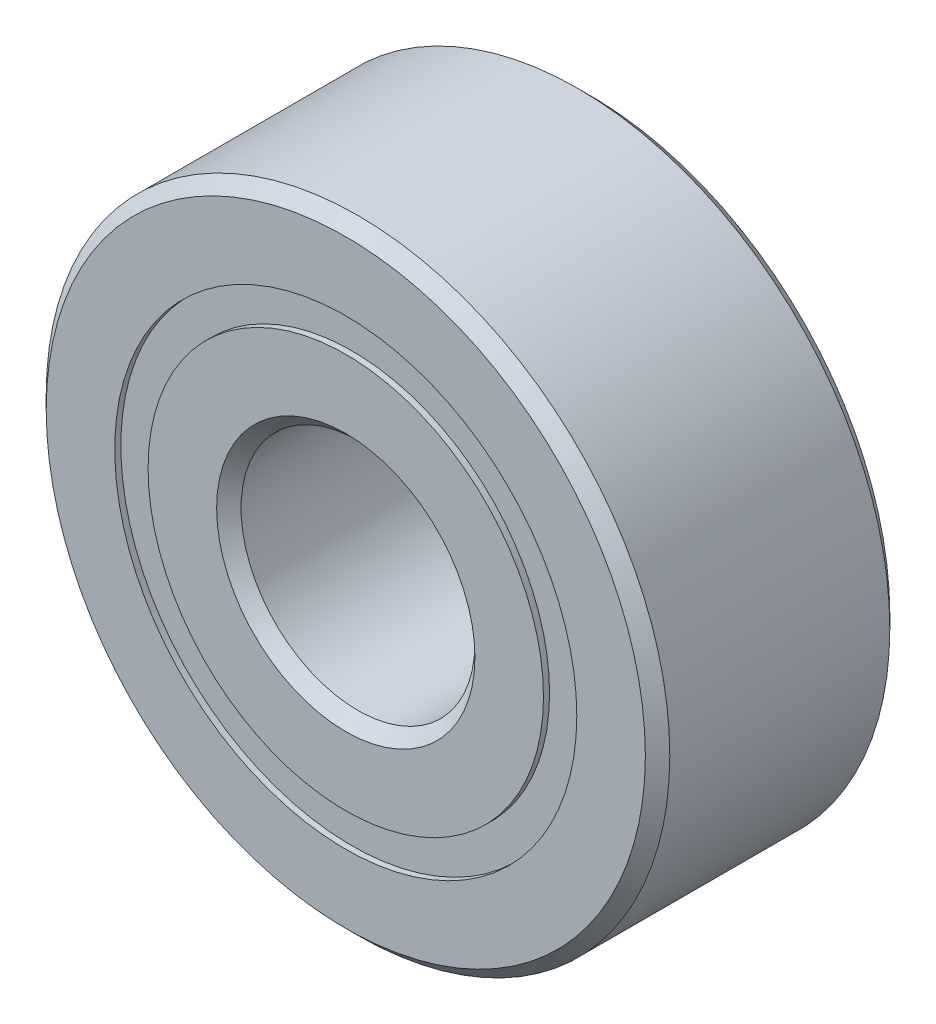
ISO-10303-21;
HEADER;
FILE_DESCRIPTION(('STEP AP214'),'2;1');
FILE_NAME('part.step','',(''),(''),'','','');
FILE_SCHEMA(('AUTOMOTIVE_DESIGN { 1 0 10303 214 1 1 1 1 }'));
ENDSEC;
DATA;
#1=APPLICATION_CONTEXT('core data for automotive mechanical design processes');
#2=APPLICATION_PROTOCOL_DEFINITION('international standard','automotive_design',2000,#1);
#3=PRODUCT_CONTEXT('',#1,'mechanical');
#4=PRODUCT('Part','Part','',(#3));
#5=PRODUCT_RELATED_PRODUCT_CATEGORY('part','',(#4));
#6=PRODUCT_DEFINITION_FORMATION('','',#4);
#7=PRODUCT_DEFINITION_CONTEXT('part definition',#1,'design');
#8=PRODUCT_DEFINITION('design','',#6,#7);
#9=PRODUCT_DEFINITION_SHAPE('','',#8);
#10=(LENGTH_UNIT() NAMED_UNIT(*) SI_UNIT(.MILLI.,.METRE.));
#11=(NAMED_UNIT(*) PLANE_ANGLE_UNIT() SI_UNIT($,.RADIAN.));
#12=(NAMED_UNIT(*) SI_UNIT($,.STERADIAN.) SOLID_ANGLE_UNIT());
#13=UNCERTAINTY_MEASURE_WITH_UNIT(LENGTH_MEASURE(1.E-05),#10,'distance_accuracy_value','');
#14=(GEOMETRIC_REPRESENTATION_CONTEXT(3) GLOBAL_UNCERTAINTY_ASSIGNED_CONTEXT((#13)) GLOBAL_UNIT_ASSIGNED_CONTEXT((#10,
#11,#12)) REPRESENTATION_CONTEXT('',''));
#15=CARTESIAN_POINT('',(0.,0.,0.));
#16=DIRECTION('',(0.,0.,1.));
#17=DIRECTION('',(1.,0.,0.));
#18=AXIS2_PLACEMENT_3D('',#15,#16,#17);
#19=CARTESIAN_POINT('',(0.,4.70503598901099,-2.36474000000001));
#20=DIRECTION('',(0.,0.,1.));
#21=DIRECTION('',(1.,0.,0.));
#22=AXIS2_PLACEMENT_3D('',#19,#20,#21);
#23=PLANE('',#22);
#24=CARTESIAN_POINT('',(0.,0.,-2.36474000000001));
#25=DIRECTION('',(0.,0.,1.));
#26=DIRECTION('',(1.,0.,0.));
#27=AXIS2_PLACEMENT_3D('',#24,#25,#26);
#28=CIRCLE('',#27,4.70503598901099);
#29=CARTESIAN_POINT('',(4.70503598901099,0.,-2.36474000000001));
#30=VERTEX_POINT('',#29);
#31=EDGE_CURVE('E70',#30,#30,#28,.T.);
#32=ORIENTED_EDGE('',*,*,#31,.F.);
#33=EDGE_LOOP('',(#32));
#34=FACE_BOUND('',#33,.T.);
#35=CARTESIAN_POINT('',(0.,0.,-2.36474000000001));
#36=DIRECTION('',(0.,0.,1.));
#37=DIRECTION('',(1.,0.,0.));
#38=AXIS2_PLACEMENT_3D('',#35,#36,#37);
#39=CIRCLE('',#38,4.02621401098901);
#40=CARTESIAN_POINT('',(4.02621401098901,0.,-2.36474000000001));
#41=VERTEX_POINT('',#40);
#42=EDGE_CURVE('E11',#41,#41,#39,.T.);
#43=ORIENTED_EDGE('',*,*,#42,.T.);
#44=EDGE_LOOP('',(#43));
#45=FACE_BOUND('',#44,.T.);
#46=ADVANCED_FACE('F56',(#34,#45),#23,.F.);
#47=CARTESIAN_POINT('',(0.,0.,2.4892));
#48=DIRECTION('',(0.,0.,1.));
#49=DIRECTION('',(1.,0.,0.));
#50=AXIS2_PLACEMENT_3D('',#47,#48,#49);
#51=CYLINDRICAL_SURFACE('',#50,4.02621401098901);
#52=ORIENTED_EDGE('',*,*,#42,.F.);
#53=EDGE_LOOP('',(#52));
#54=FACE_BOUND('',#53,.T.);
#55=CARTESIAN_POINT('',(0.,0.,-1.15720529467736));
#56=DIRECTION('',(0.,0.,1.));
#57=DIRECTION('',(1.,0.,0.));
#58=AXIS2_PLACEMENT_3D('',#55,#56,#57);
#59=CIRCLE('',#58,4.02621401098901);
#60=CARTESIAN_POINT('',(4.02621401098901,0.,-1.15720529467736));
#61=VERTEX_POINT('',#60);
#62=EDGE_CURVE('E62',#61,#61,#59,.T.);
#63=ORIENTED_EDGE('',*,*,#62,.T.);
#64=EDGE_LOOP('',(#63));
#65=FACE_BOUND('',#64,.T.);
#66=ADVANCED_FACE('F79',(#54,#65),#51,.F.);
#67=CARTESIAN_POINT('',(0.,4.70503598901099,-1.15720529467736));
#68=DIRECTION('',(0.,0.,-1.));
#69=DIRECTION('',(-1.,0.,0.));
#70=AXIS2_PLACEMENT_3D('',#67,#68,#69);
#71=PLANE('',#70);
#72=ORIENTED_EDGE('',*,*,#62,.F.);
#73=EDGE_LOOP('',(#72));
#74=FACE_BOUND('',#73,.T.);
#75=CARTESIAN_POINT('',(0.,0.,-1.15720529467736));
#76=DIRECTION('',(0.,0.,1.));
#77=DIRECTION('',(1.,0.,0.));
#78=AXIS2_PLACEMENT_3D('',#75,#76,#77);
#79=CIRCLE('',#78,4.70503598901099);
#80=CARTESIAN_POINT('',(4.70503598901099,0.,-1.15720529467736));
#81=VERTEX_POINT('',#80);
#82=EDGE_CURVE('E66',#81,#81,#79,.T.);
#83=ORIENTED_EDGE('',*,*,#82,.T.);
#84=EDGE_LOOP('',(#83));
#85=FACE_BOUND('',#84,.T.);
#86=ADVANCED_FACE('F83',(#74,#85),#71,.F.);
#87=CARTESIAN_POINT('',(0.,0.,2.4892));
#88=DIRECTION('',(0.,0.,1.));
#89=DIRECTION('',(1.,0.,0.));
#90=AXIS2_PLACEMENT_3D('',#87,#88,#89);
#91=CYLINDRICAL_SURFACE('',#90,4.70503598901099);
#92=ORIENTED_EDGE('',*,*,#82,.F.);
#93=EDGE_LOOP('',(#92));
#94=FACE_BOUND('',#93,.T.);
#95=ORIENTED_EDGE('',*,*,#31,.T.);
#96=EDGE_LOOP('',(#95));
#97=FACE_BOUND('',#96,.T.);
#98=ADVANCED_FACE('F76',(#94,#97),#91,.T.);
#99=CLOSED_SHELL('',(#46,#66,#86,#98));
#100=MANIFOLD_SOLID_BREP('B2',#99);
#101=CARTESIAN_POINT('',(0.,4.70503598901099,2.36474));
#102=DIRECTION('',(0.,0.,-1.));
#103=DIRECTION('',(-1.,0.,0.));
#104=AXIS2_PLACEMENT_3D('',#101,#102,#103);
#105=PLANE('',#104);
#106=CARTESIAN_POINT('',(0.,0.,2.36474));
#107=DIRECTION('',(0.,0.,1.));
#108=DIRECTION('',(1.,0.,0.));
#109=AXIS2_PLACEMENT_3D('',#106,#107,#108);
#110=CIRCLE('',#109,4.02621401098901);
#111=CARTESIAN_POINT('',(4.02621401098901,0.,2.36474));
#112=VERTEX_POINT('',#111);
#113=EDGE_CURVE('E55',#112,#112,#110,.T.);
#114=ORIENTED_EDGE('',*,*,#113,.F.);
#115=EDGE_LOOP('',(#114));
#116=FACE_BOUND('',#115,.T.);
#117=CARTESIAN_POINT('',(0.,0.,2.36474));
#118=DIRECTION('',(0.,0.,1.));
#119=DIRECTION('',(1.,0.,0.));
#120=AXIS2_PLACEMENT_3D('',#117,#118,#119);
#121=CIRCLE('',#120,4.70503598901099);
#122=CARTESIAN_POINT('',(4.70503598901099,0.,2.36474));
#123=VERTEX_POINT('',#122);
#124=EDGE_CURVE('E146',#123,#123,#121,.T.);
#125=ORIENTED_EDGE('',*,*,#124,.T.);
#126=EDGE_LOOP('',(#125));
#127=FACE_BOUND('',#126,.T.);
#128=ADVANCED_FACE('F132',(#116,#127),#105,.F.);
#129=CARTESIAN_POINT('',(0.,0.,2.4892));
#130=DIRECTION('',(0.,0.,1.));
#131=DIRECTION('',(1.,0.,0.));
#132=AXIS2_PLACEMENT_3D('',#129,#130,#131);
#133=CYLINDRICAL_SURFACE('',#132,4.02621401098901);
#134=CARTESIAN_POINT('',(0.,0.,1.15720529467736));
#135=DIRECTION('',(0.,0.,1.));
#136=DIRECTION('',(1.,0.,0.));
#137=AXIS2_PLACEMENT_3D('',#134,#135,#136);
#138=CIRCLE('',#137,4.02621401098901);
#139=CARTESIAN_POINT('',(4.02621401098901,0.,1.15720529467736));
#140=VERTEX_POINT('',#139);
#141=EDGE_CURVE('E138',#140,#140,#138,.T.);
#142=ORIENTED_EDGE('',*,*,#141,.F.);
#143=EDGE_LOOP('',(#142));
#144=FACE_BOUND('',#143,.T.);
#145=ORIENTED_EDGE('',*,*,#113,.T.);
#146=EDGE_LOOP('',(#145));
#147=FACE_BOUND('',#146,.T.);
#148=ADVANCED_FACE('F161',(#144,#147),#133,.F.);
#149=CARTESIAN_POINT('',(0.,4.70503598901099,1.15720529467736));
#150=DIRECTION('',(0.,0.,1.));
#151=DIRECTION('',(1.,0.,0.));
#152=AXIS2_PLACEMENT_3D('',#149,#150,#151);
#153=PLANE('',#152);
#154=CARTESIAN_POINT('',(0.,0.,1.15720529467736));
#155=DIRECTION('',(0.,0.,1.));
#156=DIRECTION('',(1.,0.,0.));
#157=AXIS2_PLACEMENT_3D('',#154,#155,#156);
#158=CIRCLE('',#157,4.70503598901099);
#159=CARTESIAN_POINT('',(4.70503598901099,0.,1.15720529467736));
#160=VERTEX_POINT('',#159);
#161=EDGE_CURVE('E142',#160,#160,#158,.T.);
#162=ORIENTED_EDGE('',*,*,#161,.F.);
#163=EDGE_LOOP('',(#162));
#164=FACE_BOUND('',#163,.T.);
#165=ORIENTED_EDGE('',*,*,#141,.T.);
#166=EDGE_LOOP('',(#165));
#167=FACE_BOUND('',#166,.T.);
#168=ADVANCED_FACE('F156',(#164,#167),#153,.F.);
#169=CARTESIAN_POINT('',(0.,0.,2.4892));
#170=DIRECTION('',(0.,0.,1.));
#171=DIRECTION('',(1.,0.,0.));
#172=AXIS2_PLACEMENT_3D('',#169,#170,#171);
#173=CYLINDRICAL_SURFACE('',#172,4.70503598901099);
#174=ORIENTED_EDGE('',*,*,#124,.F.);
#175=EDGE_LOOP('',(#174));
#176=FACE_BOUND('',#175,.T.);
#177=ORIENTED_EDGE('',*,*,#161,.T.);
#178=EDGE_LOOP('',(#177));
#179=FACE_BOUND('',#178,.T.);
#180=ADVANCED_FACE('F153',(#176,#179),#173,.T.);
#181=CLOSED_SHELL('',(#128,#148,#168,#180));
#182=MANIFOLD_SOLID_BREP('B6',#181);
#183=CARTESIAN_POINT('',(-3.08696304161748,3.08696304161756,0.));
#184=DIRECTION('',(0.,0.,1.));
#185=DIRECTION('',(-0.707106781186539,0.707106781186556,0.));
#186=AXIS2_PLACEMENT_3D('',#183,#184,#185);
#187=SPHERICAL_SURFACE('',#186,1.15720529467736);
#188=CARTESIAN_POINT('',(-3.08696304161748,3.08696304161756,1.15720529467736));
#189=VERTEX_POINT('',#188);
#190=VERTEX_LOOP('',#189);
#191=FACE_BOUND('',#190,.T.);
#192=ADVANCED_FACE('F208',(#191),#187,.T.);
#193=CLOSED_SHELL('',(#192));
#194=MANIFOLD_SOLID_BREP('B50',#193);
#195=CARTESIAN_POINT('',(-4.365625,0.,0.));
#196=DIRECTION('',(0.,0.,1.));
#197=DIRECTION('',(-1.,0.,0.));
#198=AXIS2_PLACEMENT_3D('',#195,#196,#197);
#199=SPHERICAL_SURFACE('',#198,1.15720529467736);
#200=CARTESIAN_POINT('',(-4.365625,0.,1.15720529467736));
#201=VERTEX_POINT('',#200);
#202=VERTEX_LOOP('',#201);
#203=FACE_BOUND('',#202,.T.);
#204=ADVANCED_FACE('F231',(#203),#199,.T.);
#205=CLOSED_SHELL('',(#204));
#206=MANIFOLD_SOLID_BREP('B128',#205);
#207=CARTESIAN_POINT('',(-3.08696304161755,-3.0869630416175,0.));
#208=DIRECTION('',(0.,0.,1.));
#209=DIRECTION('',(-0.707106781186554,-0.707106781186541,0.));
#210=AXIS2_PLACEMENT_3D('',#207,#208,#209);
#211=SPHERICAL_SURFACE('',#210,1.15720529467736);
#212=CARTESIAN_POINT('',(-3.08696304161755,-3.0869630416175,1.15720529467736));
#213=VERTEX_POINT('',#212);
#214=VERTEX_LOOP('',#213);
#215=FACE_BOUND('',#214,.T.);
#216=ADVANCED_FACE('F254',(#215),#211,.T.);
#217=CLOSED_SHELL('',(#216));
#218=MANIFOLD_SOLID_BREP('B204',#217);
#219=CARTESIAN_POINT('',(0.,-4.365625,0.));
#220=DIRECTION('',(0.,0.,1.));
#221=DIRECTION('',(0.,-1.,0.));
#222=AXIS2_PLACEMENT_3D('',#219,#220,#221);
#223=SPHERICAL_SURFACE('',#222,1.15720529467736);
#224=CARTESIAN_POINT('',(0.,-4.365625,1.15720529467736));
#225=VERTEX_POINT('',#224);
#226=VERTEX_LOOP('',#225);
#227=FACE_BOUND('',#226,.T.);
#228=ADVANCED_FACE('F277',(#227),#223,.T.);
#229=CLOSED_SHELL('',(#228));
#230=MANIFOLD_SOLID_BREP('B227',#229);
#231=CARTESIAN_POINT('',(3.08696304161751,-3.08696304161754,0.));
#232=DIRECTION('',(0.,0.,1.));
#233=DIRECTION('',(0.707106781186544,-0.707106781186551,0.));
#234=AXIS2_PLACEMENT_3D('',#231,#232,#233);
#235=SPHERICAL_SURFACE('',#234,1.15720529467736);
#236=CARTESIAN_POINT('',(3.08696304161751,-3.08696304161754,1.15720529467736));
#237=VERTEX_POINT('',#236);
#238=VERTEX_LOOP('',#237);
#239=FACE_BOUND('',#238,.T.);
#240=ADVANCED_FACE('F300',(#239),#235,.T.);
#241=CLOSED_SHELL('',(#240));
#242=MANIFOLD_SOLID_BREP('B250',#241);
#243=CARTESIAN_POINT('',(4.365625,0.,0.));
#244=DIRECTION('',(0.,0.,1.));
#245=DIRECTION('',(1.,0.,0.));
#246=AXIS2_PLACEMENT_3D('',#243,#244,#245);
#247=SPHERICAL_SURFACE('',#246,1.15720529467736);
#248=CARTESIAN_POINT('',(4.365625,0.,1.15720529467736));
#249=VERTEX_POINT('',#248);
#250=VERTEX_LOOP('',#249);
#251=FACE_BOUND('',#250,.T.);
#252=ADVANCED_FACE('F323',(#251),#247,.T.);
#253=CLOSED_SHELL('',(#252));
#254=MANIFOLD_SOLID_BREP('B273',#253);
#255=CARTESIAN_POINT('',(3.08696304161753,3.08696304161752,0.));
#256=DIRECTION('',(0.,0.,1.));
#257=DIRECTION('',(0.707106781186549,0.707106781186546,0.));
#258=AXIS2_PLACEMENT_3D('',#255,#256,#257);
#259=SPHERICAL_SURFACE('',#258,1.15720529467736);
#260=CARTESIAN_POINT('',(3.08696304161753,3.08696304161752,1.15720529467736));
#261=VERTEX_POINT('',#260);
#262=VERTEX_LOOP('',#261);
#263=FACE_BOUND('',#262,.T.);
#264=ADVANCED_FACE('F346',(#263),#259,.T.);
#265=CLOSED_SHELL('',(#264));
#266=MANIFOLD_SOLID_BREP('B296',#265);
#267=CARTESIAN_POINT('',(0.,4.365625,0.));
#268=DIRECTION('',(0.,0.,1.));
#269=DIRECTION('',(0.,1.,0.));
#270=AXIS2_PLACEMENT_3D('',#267,#268,#269);
#271=SPHERICAL_SURFACE('',#270,1.15720529467736);
#272=CARTESIAN_POINT('',(0.,4.365625,1.15720529467736));
#273=VERTEX_POINT('',#272);
#274=VERTEX_LOOP('',#273);
#275=FACE_BOUND('',#274,.T.);
#276=ADVANCED_FACE('F371',(#275),#271,.T.);
#277=CLOSED_SHELL('',(#276));
#278=MANIFOLD_SOLID_BREP('B319',#277);
#279=CARTESIAN_POINT('',(0.,4.02621401098901,2.4892));
#280=DIRECTION('',(0.,0.,-1.));
#281=DIRECTION('',(-1.,0.,0.));
#282=AXIS2_PLACEMENT_3D('',#279,#280,#281);
#283=PLANE('',#282);
#284=CARTESIAN_POINT('',(0.,0.,2.4892));
#285=DIRECTION('',(0.,0.,1.));
#286=DIRECTION('',(1.,0.,0.));
#287=AXIS2_PLACEMENT_3D('',#284,#285,#286);
#288=CIRCLE('',#287,2.63017);
#289=CARTESIAN_POINT('',(2.63017,0.,2.4892));
#290=VERTEX_POINT('',#289);
#291=EDGE_CURVE('E417',#290,#290,#288,.T.);
#292=ORIENTED_EDGE('',*,*,#291,.F.);
#293=EDGE_LOOP('',(#292));
#294=FACE_BOUND('',#293,.T.);
#295=CARTESIAN_POINT('',(0.,0.,2.4892));
#296=DIRECTION('',(0.,0.,1.));
#297=DIRECTION('',(1.,0.,0.));
#298=AXIS2_PLACEMENT_3D('',#295,#296,#297);
#299=CIRCLE('',#298,4.02621401098901);
#300=CARTESIAN_POINT('',(4.02621401098901,0.,2.4892));
#301=VERTEX_POINT('',#300);
#302=EDGE_CURVE('E370',#301,#301,#299,.T.);
#303=ORIENTED_EDGE('',*,*,#302,.T.);
#304=EDGE_LOOP('',(#303));
#305=FACE_BOUND('',#304,.T.);
#306=ADVANCED_FACE('F389',(#294,#305),#283,.F.);
#307=CARTESIAN_POINT('',(0.,0.,2.4892));
#308=DIRECTION('',(0.,0.,1.));
#309=DIRECTION('',(1.,0.,0.));
#310=AXIS2_PLACEMENT_3D('',#307,#308,#309);
#311=CYLINDRICAL_SURFACE('',#310,4.02621401098901);
#312=ORIENTED_EDGE('',*,*,#302,.F.);
#313=EDGE_LOOP('',(#312));
#314=FACE_BOUND('',#313,.T.);
#315=CARTESIAN_POINT('',(0.,0.,1.10631111111111));
#316=DIRECTION('',(0.,0.,1.));
#317=DIRECTION('',(1.,0.,0.));
#318=AXIS2_PLACEMENT_3D('',#315,#316,#317);
#319=CIRCLE('',#318,4.02621401098901);
#320=CARTESIAN_POINT('',(4.02621401098901,0.,1.10631111111111));
#321=VERTEX_POINT('',#320);
#322=EDGE_CURVE('E395',#321,#321,#319,.T.);
#323=ORIENTED_EDGE('',*,*,#322,.T.);
#324=EDGE_LOOP('',(#323));
#325=FACE_BOUND('',#324,.T.);
#326=ADVANCED_FACE('F424',(#314,#325),#311,.T.);
#327=CARTESIAN_POINT('',(0.,0.,0.));
#328=DIRECTION('',(0.,0.,1.));
#329=DIRECTION('',(1.,0.,0.));
#330=AXIS2_PLACEMENT_3D('',#327,#328,#329);
#331=TOROIDAL_SURFACE('',#330,4.36562499999999,1.15720529467736);
#332=ORIENTED_EDGE('',*,*,#322,.F.);
#333=EDGE_LOOP('',(#332));
#334=FACE_BOUND('',#333,.T.);
#335=CARTESIAN_POINT('',(0.,0.,-1.10631111111111));
#336=DIRECTION('',(0.,0.,1.));
#337=DIRECTION('',(1.,0.,0.));
#338=AXIS2_PLACEMENT_3D('',#335,#336,#337);
#339=CIRCLE('',#338,4.02621401098901);
#340=CARTESIAN_POINT('',(4.02621401098901,0.,-1.10631111111111));
#341=VERTEX_POINT('',#340);
#342=EDGE_CURVE('E399',#341,#341,#339,.T.);
#343=ORIENTED_EDGE('',*,*,#342,.T.);
#344=EDGE_LOOP('',(#343));
#345=FACE_BOUND('',#344,.T.);
#346=ADVANCED_FACE('F428',(#334,#345),#331,.F.);
#347=CARTESIAN_POINT('',(0.,0.,2.4892));
#348=DIRECTION('',(0.,0.,1.));
#349=DIRECTION('',(1.,0.,0.));
#350=AXIS2_PLACEMENT_3D('',#347,#348,#349);
#351=CYLINDRICAL_SURFACE('',#350,4.02621401098901);
#352=ORIENTED_EDGE('',*,*,#342,.F.);
#353=EDGE_LOOP('',(#352));
#354=FACE_BOUND('',#353,.T.);
#355=CARTESIAN_POINT('',(0.,0.,-2.4892));
#356=DIRECTION('',(0.,0.,1.));
#357=DIRECTION('',(1.,0.,0.));
#358=AXIS2_PLACEMENT_3D('',#355,#356,#357);
#359=CIRCLE('',#358,4.02621401098901);
#360=CARTESIAN_POINT('',(4.02621401098901,0.,-2.4892));
#361=VERTEX_POINT('',#360);
#362=EDGE_CURVE('E403',#361,#361,#359,.T.);
#363=ORIENTED_EDGE('',*,*,#362,.T.);
#364=EDGE_LOOP('',(#363));
#365=FACE_BOUND('',#364,.T.);
#366=ADVANCED_FACE('F433',(#354,#365),#351,.T.);
#367=CARTESIAN_POINT('',(0.,2.63017,-2.48920000000001));
#368=DIRECTION('',(0.,0.,1.));
#369=DIRECTION('',(1.,0.,0.));
#370=AXIS2_PLACEMENT_3D('',#367,#368,#369);
#371=PLANE('',#370);
#372=ORIENTED_EDGE('',*,*,#362,.F.);
#373=EDGE_LOOP('',(#372));
#374=FACE_BOUND('',#373,.T.);
#375=CARTESIAN_POINT('',(0.,0.,-2.48920000000001));
#376=DIRECTION('',(0.,0.,1.));
#377=DIRECTION('',(1.,0.,0.));
#378=AXIS2_PLACEMENT_3D('',#375,#376,#377);
#379=CIRCLE('',#378,2.63017);
#380=CARTESIAN_POINT('',(2.63017,0.,-2.48920000000001));
#381=VERTEX_POINT('',#380);
#382=EDGE_CURVE('E408',#381,#381,#379,.T.);
#383=ORIENTED_EDGE('',*,*,#382,.T.);
#384=EDGE_LOOP('',(#383));
#385=FACE_BOUND('',#384,.T.);
#386=ADVANCED_FACE('F439',(#374,#385),#371,.F.);
#387=CARTESIAN_POINT('',(0.,0.,-2.24028000000001));
#388=DIRECTION('',(0.,0.,-1.));
#389=DIRECTION('',(-1.,0.,0.));
#390=AXIS2_PLACEMENT_3D('',#387,#388,#389);
#391=CONICAL_SURFACE('',#390,2.38125,0.785398163397448);
#392=ORIENTED_EDGE('',*,*,#382,.F.);
#393=EDGE_LOOP('',(#392));
#394=FACE_BOUND('',#393,.T.);
#395=CARTESIAN_POINT('',(0.,0.,-2.24028000000001));
#396=DIRECTION('',(0.,0.,1.));
#397=DIRECTION('',(1.,0.,0.));
#398=AXIS2_PLACEMENT_3D('',#395,#396,#397);
#399=CIRCLE('',#398,2.38125);
#400=CARTESIAN_POINT('',(2.38125,0.,-2.24028000000001));
#401=VERTEX_POINT('',#400);
#402=EDGE_CURVE('E411',#401,#401,#399,.T.);
#403=ORIENTED_EDGE('',*,*,#402,.T.);
#404=EDGE_LOOP('',(#403));
#405=FACE_BOUND('',#404,.T.);
#406=ADVANCED_FACE('F443',(#394,#405),#391,.F.);
#407=CARTESIAN_POINT('',(0.,0.,2.4892));
#408=DIRECTION('',(0.,0.,1.));
#409=DIRECTION('',(1.,0.,0.));
#410=AXIS2_PLACEMENT_3D('',#407,#408,#409);
#411=CYLINDRICAL_SURFACE('',#410,2.38125);
#412=ORIENTED_EDGE('',*,*,#402,.F.);
#413=EDGE_LOOP('',(#412));
#414=FACE_BOUND('',#413,.T.);
#415=CARTESIAN_POINT('',(0.,0.,2.24028));
#416=DIRECTION('',(0.,0.,1.));
#417=DIRECTION('',(1.,0.,0.));
#418=AXIS2_PLACEMENT_3D('',#415,#416,#417);
#419=CIRCLE('',#418,2.38125);
#420=CARTESIAN_POINT('',(2.38125,0.,2.24028));
#421=VERTEX_POINT('',#420);
#422=EDGE_CURVE('E414',#421,#421,#419,.T.);
#423=ORIENTED_EDGE('',*,*,#422,.T.);
#424=EDGE_LOOP('',(#423));
#425=FACE_BOUND('',#424,.T.);
#426=ADVANCED_FACE('F447',(#414,#425),#411,.F.);
#427=CARTESIAN_POINT('',(0.,0.,2.4892));
#428=DIRECTION('',(0.,0.,1.));
#429=DIRECTION('',(1.,0.,0.));
#430=AXIS2_PLACEMENT_3D('',#427,#428,#429);
#431=CONICAL_SURFACE('',#430,2.63017,0.785398163397447);
#432=ORIENTED_EDGE('',*,*,#422,.F.);
#433=EDGE_LOOP('',(#432));
#434=FACE_BOUND('',#433,.T.);
#435=ORIENTED_EDGE('',*,*,#291,.T.);
#436=EDGE_LOOP('',(#435));
#437=FACE_BOUND('',#436,.T.);
#438=ADVANCED_FACE('F421',(#434,#437),#431,.F.);
#439=CLOSED_SHELL('',(#306,#326,#346,#366,#386,#406,#426,#438));
#440=MANIFOLD_SOLID_BREP('B342',#439);
#441=CARTESIAN_POINT('',(0.,0.,2.24028));
#442=DIRECTION('',(0.,0.,-1.));
#443=DIRECTION('',(-1.,0.,0.));
#444=AXIS2_PLACEMENT_3D('',#441,#442,#443);
#445=CONICAL_SURFACE('',#444,6.35,0.785398163397447);
#446=CARTESIAN_POINT('',(0.,0.,2.4892));
#447=DIRECTION('',(0.,0.,1.));
#448=DIRECTION('',(1.,0.,0.));
#449=AXIS2_PLACEMENT_3D('',#446,#447,#448);
#450=CIRCLE('',#449,6.10108);
#451=CARTESIAN_POINT('',(6.10108,0.,2.4892));
#452=VERTEX_POINT('',#451);
#453=EDGE_CURVE('E530',#452,#452,#450,.T.);
#454=ORIENTED_EDGE('',*,*,#453,.F.);
#455=EDGE_LOOP('',(#454));
#456=FACE_BOUND('',#455,.T.);
#457=CARTESIAN_POINT('',(0.,0.,2.24028));
#458=DIRECTION('',(0.,0.,1.));
#459=DIRECTION('',(1.,0.,0.));
#460=AXIS2_PLACEMENT_3D('',#457,#458,#459);
#461=CIRCLE('',#460,6.35);
#462=CARTESIAN_POINT('',(6.35,0.,2.24028));
#463=VERTEX_POINT('',#462);
#464=EDGE_CURVE('E388',#463,#463,#461,.T.);
#465=ORIENTED_EDGE('',*,*,#464,.T.);
#466=EDGE_LOOP('',(#465));
#467=FACE_BOUND('',#466,.T.);
#468=ADVANCED_FACE('F495',(#456,#467),#445,.T.);
#469=CARTESIAN_POINT('',(0.,0.,2.4892));
#470=DIRECTION('',(0.,0.,1.));
#471=DIRECTION('',(1.,0.,0.));
#472=AXIS2_PLACEMENT_3D('',#469,#470,#471);
#473=CYLINDRICAL_SURFACE('',#472,6.35);
#474=ORIENTED_EDGE('',*,*,#464,.F.);
#475=EDGE_LOOP('',(#474));
#476=FACE_BOUND('',#475,.T.);
#477=CARTESIAN_POINT('',(0.,0.,-2.24028000000001));
#478=DIRECTION('',(0.,0.,1.));
#479=DIRECTION('',(1.,0.,0.));
#480=AXIS2_PLACEMENT_3D('',#477,#478,#479);
#481=CIRCLE('',#480,6.35);
#482=CARTESIAN_POINT('',(6.35,0.,-2.24028000000001));
#483=VERTEX_POINT('',#482);
#484=EDGE_CURVE('E502',#483,#483,#481,.T.);
#485=ORIENTED_EDGE('',*,*,#484,.T.);
#486=EDGE_LOOP('',(#485));
#487=FACE_BOUND('',#486,.T.);
#488=ADVANCED_FACE('F538',(#476,#487),#473,.T.);
#489=CARTESIAN_POINT('',(0.,0.,-2.48920000000001));
#490=DIRECTION('',(0.,0.,1.));
#491=DIRECTION('',(1.,0.,0.));
#492=AXIS2_PLACEMENT_3D('',#489,#490,#491);
#493=CONICAL_SURFACE('',#492,6.10108,0.785398163397448);
#494=ORIENTED_EDGE('',*,*,#484,.F.);
#495=EDGE_LOOP('',(#494));
#496=FACE_BOUND('',#495,.T.);
#497=CARTESIAN_POINT('',(0.,0.,-2.48920000000001));
#498=DIRECTION('',(0.,0.,1.));
#499=DIRECTION('',(1.,0.,0.));
#500=AXIS2_PLACEMENT_3D('',#497,#498,#499);
#501=CIRCLE('',#500,6.10108);
#502=CARTESIAN_POINT('',(6.10108,0.,-2.48920000000001));
#503=VERTEX_POINT('',#502);
#504=EDGE_CURVE('E507',#503,#503,#501,.T.);
#505=ORIENTED_EDGE('',*,*,#504,.T.);
#506=EDGE_LOOP('',(#505));
#507=FACE_BOUND('',#506,.T.);
#508=ADVANCED_FACE('F542',(#496,#507),#493,.T.);
#509=CARTESIAN_POINT('',(0.,6.10108,-2.48920000000001));
#510=DIRECTION('',(0.,0.,1.));
#511=DIRECTION('',(1.,0.,0.));
#512=AXIS2_PLACEMENT_3D('',#509,#510,#511);
#513=PLANE('',#512);
#514=ORIENTED_EDGE('',*,*,#504,.F.);
#515=EDGE_LOOP('',(#514));
#516=FACE_BOUND('',#515,.T.);
#517=CARTESIAN_POINT('',(0.,0.,-2.48920000000001));
#518=DIRECTION('',(0.,0.,1.));
#519=DIRECTION('',(1.,0.,0.));
#520=AXIS2_PLACEMENT_3D('',#517,#518,#519);
#521=CIRCLE('',#520,4.70503598901099);
#522=CARTESIAN_POINT('',(4.70503598901099,0.,-2.48920000000001));
#523=VERTEX_POINT('',#522);
#524=EDGE_CURVE('E512',#523,#523,#521,.T.);
#525=ORIENTED_EDGE('',*,*,#524,.T.);
#526=EDGE_LOOP('',(#525));
#527=FACE_BOUND('',#526,.T.);
#528=ADVANCED_FACE('F547',(#516,#527),#513,.F.);
#529=CARTESIAN_POINT('',(0.,0.,2.4892));
#530=DIRECTION('',(0.,0.,1.));
#531=DIRECTION('',(1.,0.,0.));
#532=AXIS2_PLACEMENT_3D('',#529,#530,#531);
#533=CYLINDRICAL_SURFACE('',#532,4.70503598901099);
#534=ORIENTED_EDGE('',*,*,#524,.F.);
#535=EDGE_LOOP('',(#534));
#536=FACE_BOUND('',#535,.T.);
#537=CARTESIAN_POINT('',(0.,0.,-1.10631111111111));
#538=DIRECTION('',(0.,0.,1.));
#539=DIRECTION('',(1.,0.,0.));
#540=AXIS2_PLACEMENT_3D('',#537,#538,#539);
#541=CIRCLE('',#540,4.70503598901099);
#542=CARTESIAN_POINT('',(4.70503598901099,0.,-1.10631111111111));
#543=VERTEX_POINT('',#542);
#544=EDGE_CURVE('E518',#543,#543,#541,.T.);
#545=ORIENTED_EDGE('',*,*,#544,.T.);
#546=EDGE_LOOP('',(#545));
#547=FACE_BOUND('',#546,.T.);
#548=ADVANCED_FACE('F553',(#536,#547),#533,.F.);
#549=CARTESIAN_POINT('',(0.,0.,0.));
#550=DIRECTION('',(0.,0.,1.));
#551=DIRECTION('',(1.,0.,0.));
#552=AXIS2_PLACEMENT_3D('',#549,#550,#551);
#553=TOROIDAL_SURFACE('',#552,4.365625,1.15720529467736);
#554=ORIENTED_EDGE('',*,*,#544,.F.);
#555=EDGE_LOOP('',(#554));
#556=FACE_BOUND('',#555,.T.);
#557=CARTESIAN_POINT('',(0.,0.,1.10631111111111));
#558=DIRECTION('',(0.,0.,1.));
#559=DIRECTION('',(1.,0.,0.));
#560=AXIS2_PLACEMENT_3D('',#557,#558,#559);
#561=CIRCLE('',#560,4.70503598901099);
#562=CARTESIAN_POINT('',(4.70503598901099,0.,1.10631111111111));
#563=VERTEX_POINT('',#562);
#564=EDGE_CURVE('E522',#563,#563,#561,.T.);
#565=ORIENTED_EDGE('',*,*,#564,.T.);
#566=EDGE_LOOP('',(#565));
#567=FACE_BOUND('',#566,.T.);
#568=ADVANCED_FACE('F557',(#556,#567),#553,.F.);
#569=CARTESIAN_POINT('',(0.,0.,2.4892));
#570=DIRECTION('',(0.,0.,1.));
#571=DIRECTION('',(1.,0.,0.));
#572=AXIS2_PLACEMENT_3D('',#569,#570,#571);
#573=CYLINDRICAL_SURFACE('',#572,4.70503598901099);
#574=ORIENTED_EDGE('',*,*,#564,.F.);
#575=EDGE_LOOP('',(#574));
#576=FACE_BOUND('',#575,.T.);
#577=CARTESIAN_POINT('',(0.,0.,2.4892));
#578=DIRECTION('',(0.,0.,1.));
#579=DIRECTION('',(1.,0.,0.));
#580=AXIS2_PLACEMENT_3D('',#577,#578,#579);
#581=CIRCLE('',#580,4.70503598901099);
#582=CARTESIAN_POINT('',(4.70503598901099,0.,2.4892));
#583=VERTEX_POINT('',#582);
#584=EDGE_CURVE('E526',#583,#583,#581,.T.);
#585=ORIENTED_EDGE('',*,*,#584,.T.);
#586=EDGE_LOOP('',(#585));
#587=FACE_BOUND('',#586,.T.);
#588=ADVANCED_FACE('F561',(#576,#587),#573,.F.);
#589=CARTESIAN_POINT('',(0.,6.10108,2.4892));
#590=DIRECTION('',(0.,0.,-1.));
#591=DIRECTION('',(-1.,0.,0.));
#592=AXIS2_PLACEMENT_3D('',#589,#590,#591);
#593=PLANE('',#592);
#594=ORIENTED_EDGE('',*,*,#584,.F.);
#595=EDGE_LOOP('',(#594));
#596=FACE_BOUND('',#595,.T.);
#597=ORIENTED_EDGE('',*,*,#453,.T.);
#598=EDGE_LOOP('',(#597));
#599=FACE_BOUND('',#598,.T.);
#600=ADVANCED_FACE('F535',(#596,#599),#593,.F.);
#601=CLOSED_SHELL('',(#468,#488,#508,#528,#548,#568,#588,#600));
#602=MANIFOLD_SOLID_BREP('B365',#601);
#603=ADVANCED_BREP_SHAPE_REPRESENTATION('',(#18,#100,#182,#194,#206,#218,#230,#242,#254,#266,
#278,#440,#602),#14);
#604=SHAPE_DEFINITION_REPRESENTATION(#9,#603);
ENDSEC;
END-ISO-10303-21;
